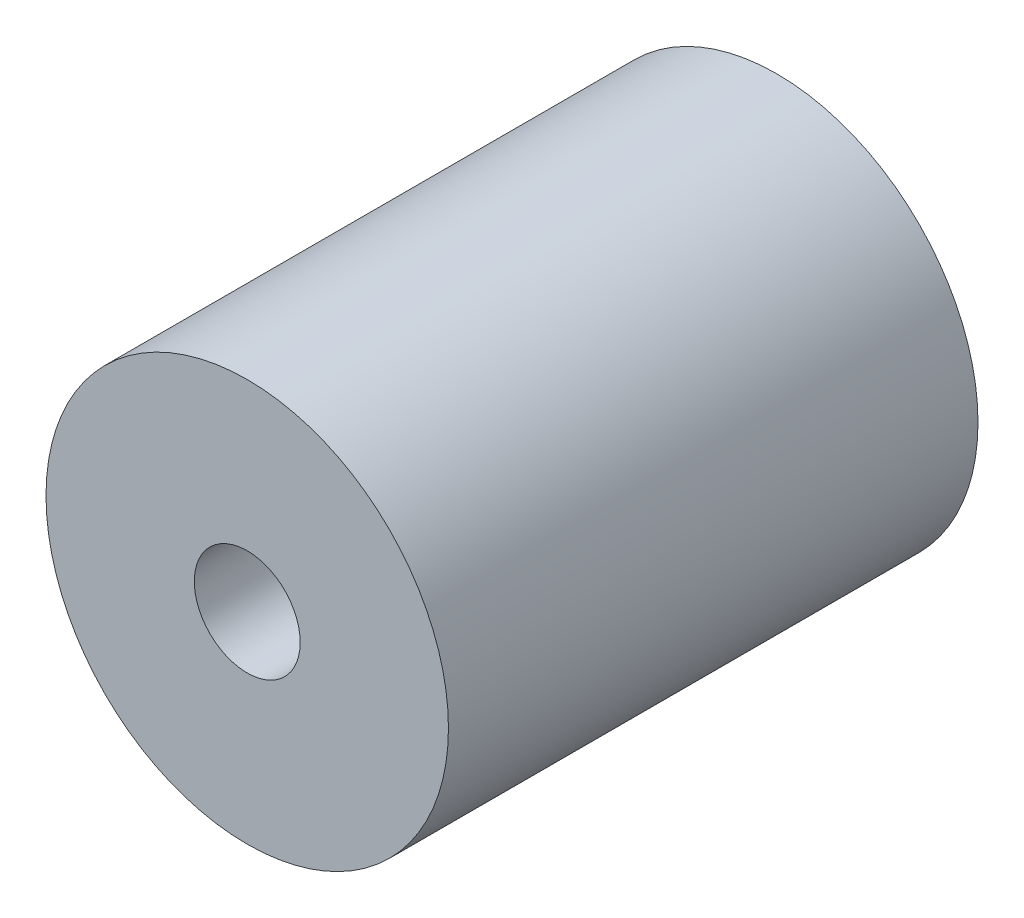
ISO-10303-21;
HEADER;
FILE_DESCRIPTION(('STEP AP214'),'2;1');
FILE_NAME('part.step','',(''),(''),'','','');
FILE_SCHEMA(('AUTOMOTIVE_DESIGN { 1 0 10303 214 1 1 1 1 }'));
ENDSEC;
DATA;
#1=APPLICATION_CONTEXT('core data for automotive mechanical design processes');
#2=APPLICATION_PROTOCOL_DEFINITION('international standard','automotive_design',2000,#1);
#3=PRODUCT_CONTEXT('',#1,'mechanical');
#4=PRODUCT('Part','Part','',(#3));
#5=PRODUCT_RELATED_PRODUCT_CATEGORY('part','',(#4));
#6=PRODUCT_DEFINITION_FORMATION('','',#4);
#7=PRODUCT_DEFINITION_CONTEXT('part definition',#1,'design');
#8=PRODUCT_DEFINITION('design','',#6,#7);
#9=PRODUCT_DEFINITION_SHAPE('','',#8);
#10=(LENGTH_UNIT() NAMED_UNIT(*) SI_UNIT(.MILLI.,.METRE.));
#11=(NAMED_UNIT(*) PLANE_ANGLE_UNIT() SI_UNIT($,.RADIAN.));
#12=(NAMED_UNIT(*) SI_UNIT($,.STERADIAN.) SOLID_ANGLE_UNIT());
#13=UNCERTAINTY_MEASURE_WITH_UNIT(LENGTH_MEASURE(1.E-05),#10,'distance_accuracy_value','');
#14=(GEOMETRIC_REPRESENTATION_CONTEXT(3) GLOBAL_UNCERTAINTY_ASSIGNED_CONTEXT((#13)) GLOBAL_UNIT_ASSIGNED_CONTEXT((#10,
#11,#12)) REPRESENTATION_CONTEXT('',''));
#15=CARTESIAN_POINT('',(0.,0.,0.));
#16=DIRECTION('',(0.,0.,1.));
#17=DIRECTION('',(1.,0.,0.));
#18=AXIS2_PLACEMENT_3D('',#15,#16,#17);
#19=CARTESIAN_POINT('',(-14.7886198372725,7.49268307369401,22.5));
#20=DIRECTION('',(0.,0.,-1.));
#21=DIRECTION('',(-1.,0.,0.));
#22=AXIS2_PLACEMENT_3D('',#19,#20,#21);
#23=CYLINDRICAL_SURFACE('',#22,9.5);
#24=CARTESIAN_POINT('',(-14.7886198372725,7.49268307369401,22.5));
#25=DIRECTION('',(0.,0.,1.));
#26=DIRECTION('',(1.,0.,0.));
#27=AXIS2_PLACEMENT_3D('',#24,#25,#26);
#28=CIRCLE('',#27,9.5);
#29=CARTESIAN_POINT('',(-5.28861983727254,7.49268307369401,22.5));
#30=VERTEX_POINT('',#29);
#31=EDGE_CURVE('E11',#30,#30,#28,.T.);
#32=ORIENTED_EDGE('',*,*,#31,.F.);
#33=EDGE_LOOP('',(#32));
#34=FACE_BOUND('',#33,.T.);
#35=CARTESIAN_POINT('',(-14.7886198372725,7.49268307369401,-2.5));
#36=DIRECTION('',(0.,0.,1.));
#37=DIRECTION('',(1.,0.,0.));
#38=AXIS2_PLACEMENT_3D('',#35,#36,#37);
#39=CIRCLE('',#38,9.5);
#40=CARTESIAN_POINT('',(-5.28861983727254,7.49268307369401,-2.5));
#41=VERTEX_POINT('',#40);
#42=EDGE_CURVE('E37',#41,#41,#39,.T.);
#43=ORIENTED_EDGE('',*,*,#42,.T.);
#44=EDGE_LOOP('',(#43));
#45=FACE_BOUND('',#44,.T.);
#46=ADVANCED_FACE('F34',(#34,#45),#23,.T.);
#47=CARTESIAN_POINT('',(-14.7886198372725,7.49268307369401,22.5));
#48=DIRECTION('',(0.,0.,1.));
#49=DIRECTION('',(1.,0.,0.));
#50=AXIS2_PLACEMENT_3D('',#47,#48,#49);
#51=PLANE('',#50);
#52=CARTESIAN_POINT('',(-14.7886198372725,7.49268307369401,22.5));
#53=DIRECTION('',(0.,0.,1.));
#54=DIRECTION('',(1.,0.,0.));
#55=AXIS2_PLACEMENT_3D('',#52,#53,#54);
#56=CIRCLE('',#55,2.5);
#57=CARTESIAN_POINT('',(-12.2886198372725,7.49268307369401,22.5));
#58=VERTEX_POINT('',#57);
#59=EDGE_CURVE('E49',#58,#58,#56,.T.);
#60=ORIENTED_EDGE('',*,*,#59,.F.);
#61=EDGE_LOOP('',(#60));
#62=FACE_BOUND('',#61,.T.);
#63=ORIENTED_EDGE('',*,*,#31,.T.);
#64=EDGE_LOOP('',(#63));
#65=FACE_BOUND('',#64,.T.);
#66=ADVANCED_FACE('F61',(#62,#65),#51,.T.);
#67=CARTESIAN_POINT('',(-14.7886198372725,7.49268307369401,-2.5));
#68=DIRECTION('',(0.,0.,1.));
#69=DIRECTION('',(1.,0.,0.));
#70=AXIS2_PLACEMENT_3D('',#67,#68,#69);
#71=PLANE('',#70);
#72=CARTESIAN_POINT('',(-14.7886198372725,7.49268307369401,-2.5));
#73=DIRECTION('',(0.,0.,1.));
#74=DIRECTION('',(1.,0.,0.));
#75=AXIS2_PLACEMENT_3D('',#72,#73,#74);
#76=CIRCLE('',#75,4.);
#77=CARTESIAN_POINT('',(-10.7886198372725,7.49268307369401,-2.5));
#78=VERTEX_POINT('',#77);
#79=EDGE_CURVE('E44',#78,#78,#76,.T.);
#80=ORIENTED_EDGE('',*,*,#79,.T.);
#81=EDGE_LOOP('',(#80));
#82=FACE_BOUND('',#81,.T.);
#83=ORIENTED_EDGE('',*,*,#42,.F.);
#84=EDGE_LOOP('',(#83));
#85=FACE_BOUND('',#84,.T.);
#86=ADVANCED_FACE('F63',(#82,#85),#71,.F.);
#87=CARTESIAN_POINT('',(-14.7886198372725,7.49268307369401,-2.5));
#88=DIRECTION('',(0.,0.,1.));
#89=DIRECTION('',(1.,0.,0.));
#90=AXIS2_PLACEMENT_3D('',#87,#88,#89);
#91=CYLINDRICAL_SURFACE('',#90,4.);
#92=ORIENTED_EDGE('',*,*,#79,.F.);
#93=EDGE_LOOP('',(#92));
#94=FACE_BOUND('',#93,.T.);
#95=CARTESIAN_POINT('',(-14.7886198372725,7.49268307369401,10.));
#96=DIRECTION('',(0.,0.,1.));
#97=DIRECTION('',(1.,0.,0.));
#98=AXIS2_PLACEMENT_3D('',#95,#96,#97);
#99=CIRCLE('',#98,4.);
#100=CARTESIAN_POINT('',(-10.7886198372725,7.49268307369401,10.));
#101=VERTEX_POINT('',#100);
#102=EDGE_CURVE('E46',#101,#101,#99,.T.);
#103=ORIENTED_EDGE('',*,*,#102,.T.);
#104=EDGE_LOOP('',(#103));
#105=FACE_BOUND('',#104,.T.);
#106=ADVANCED_FACE('F69',(#94,#105),#91,.F.);
#107=CARTESIAN_POINT('',(-14.7886198372725,7.49268307369401,10.));
#108=DIRECTION('',(0.,0.,1.));
#109=DIRECTION('',(1.,0.,0.));
#110=AXIS2_PLACEMENT_3D('',#107,#108,#109);
#111=PLANE('',#110);
#112=CARTESIAN_POINT('',(-14.7886198372725,7.49268307369401,10.));
#113=DIRECTION('',(0.,0.,1.));
#114=DIRECTION('',(1.,0.,0.));
#115=AXIS2_PLACEMENT_3D('',#112,#113,#114);
#116=CIRCLE('',#115,2.5);
#117=CARTESIAN_POINT('',(-12.2886198372725,7.49268307369401,10.));
#118=VERTEX_POINT('',#117);
#119=EDGE_CURVE('E52',#118,#118,#116,.T.);
#120=ORIENTED_EDGE('',*,*,#119,.T.);
#121=EDGE_LOOP('',(#120));
#122=FACE_BOUND('',#121,.T.);
#123=ORIENTED_EDGE('',*,*,#102,.F.);
#124=EDGE_LOOP('',(#123));
#125=FACE_BOUND('',#124,.T.);
#126=ADVANCED_FACE('F75',(#122,#125),#111,.F.);
#127=CARTESIAN_POINT('',(-14.7886198372725,7.49268307369401,22.5));
#128=DIRECTION('',(0.,0.,-1.));
#129=DIRECTION('',(-1.,0.,0.));
#130=AXIS2_PLACEMENT_3D('',#127,#128,#129);
#131=CYLINDRICAL_SURFACE('',#130,2.5);
#132=ORIENTED_EDGE('',*,*,#59,.T.);
#133=EDGE_LOOP('',(#132));
#134=FACE_BOUND('',#133,.T.);
#135=ORIENTED_EDGE('',*,*,#119,.F.);
#136=EDGE_LOOP('',(#135));
#137=FACE_BOUND('',#136,.T.);
#138=ADVANCED_FACE('F58',(#134,#137),#131,.F.);
#139=CLOSED_SHELL('',(#46,#66,#86,#106,#126,#138));
#140=MANIFOLD_SOLID_BREP('B2',#139);
#141=ADVANCED_BREP_SHAPE_REPRESENTATION('',(#18,#140),#14);
#142=SHAPE_DEFINITION_REPRESENTATION(#9,#141);
ENDSEC;
END-ISO-10303-21;
